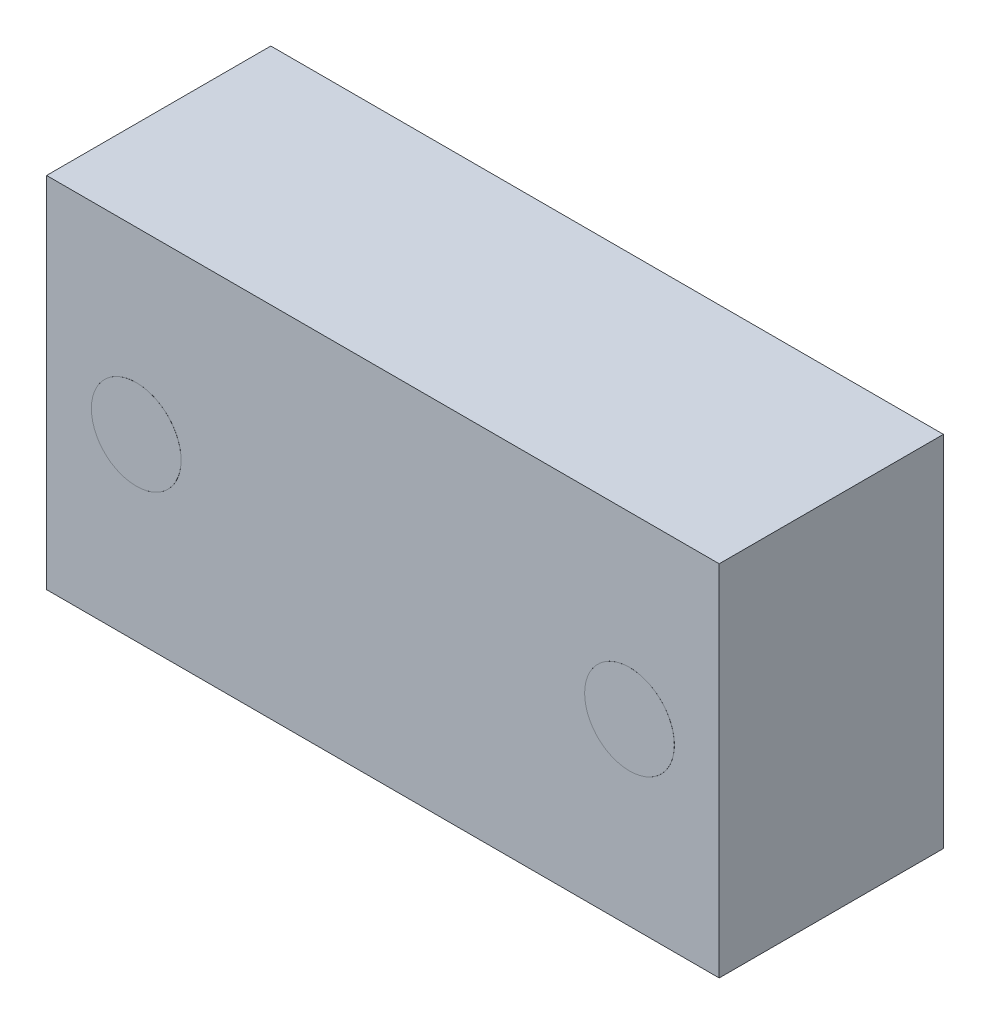
ISO-10303-21;
HEADER;
FILE_DESCRIPTION(('STEP AP214'),'2;1');
FILE_NAME('part.step','',(''),(''),'','','');
FILE_SCHEMA(('AUTOMOTIVE_DESIGN { 1 0 10303 214 1 1 1 1 }'));
ENDSEC;
DATA;
#1=APPLICATION_CONTEXT('core data for automotive mechanical design processes');
#2=APPLICATION_PROTOCOL_DEFINITION('international standard','automotive_design',2000,#1);
#3=PRODUCT_CONTEXT('',#1,'mechanical');
#4=PRODUCT('Part','Part','',(#3));
#5=PRODUCT_RELATED_PRODUCT_CATEGORY('part','',(#4));
#6=PRODUCT_DEFINITION_FORMATION('','',#4);
#7=PRODUCT_DEFINITION_CONTEXT('part definition',#1,'design');
#8=PRODUCT_DEFINITION('design','',#6,#7);
#9=PRODUCT_DEFINITION_SHAPE('','',#8);
#10=(LENGTH_UNIT() NAMED_UNIT(*) SI_UNIT(.MILLI.,.METRE.));
#11=(NAMED_UNIT(*) PLANE_ANGLE_UNIT() SI_UNIT($,.RADIAN.));
#12=(NAMED_UNIT(*) SI_UNIT($,.STERADIAN.) SOLID_ANGLE_UNIT());
#13=UNCERTAINTY_MEASURE_WITH_UNIT(LENGTH_MEASURE(1.E-05),#10,'distance_accuracy_value','');
#14=(GEOMETRIC_REPRESENTATION_CONTEXT(3) GLOBAL_UNCERTAINTY_ASSIGNED_CONTEXT((#13)) GLOBAL_UNIT_ASSIGNED_CONTEXT((#10,
#11,#12)) REPRESENTATION_CONTEXT('',''));
#15=CARTESIAN_POINT('',(0.,0.,0.));
#16=DIRECTION('',(0.,0.,1.));
#17=DIRECTION('',(1.,0.,0.));
#18=AXIS2_PLACEMENT_3D('',#15,#16,#17);
#19=CARTESIAN_POINT('',(0.,0.,5.));
#20=DIRECTION('',(1.,0.,0.));
#21=DIRECTION('',(0.,0.,-1.));
#22=AXIS2_PLACEMENT_3D('',#19,#20,#21);
#23=PLANE('',#22);
#24=DIRECTION('',(0.,-1.,0.));
#25=VECTOR('',#24,1.);
#26=CARTESIAN_POINT('',(0.,0.,0.));
#27=LINE('',#26,#25);
#28=CARTESIAN_POINT('',(0.,8.,0.));
#29=VERTEX_POINT('',#28);
#30=CARTESIAN_POINT('',(0.,0.,0.));
#31=VERTEX_POINT('',#30);
#32=EDGE_CURVE('E111',#29,#31,#27,.T.);
#33=ORIENTED_EDGE('',*,*,#32,.T.);
#34=DIRECTION('',(0.,0.,-1.));
#35=VECTOR('',#34,1.);
#36=CARTESIAN_POINT('',(0.,0.,5.));
#37=LINE('',#36,#35);
#38=CARTESIAN_POINT('',(0.,0.,5.));
#39=VERTEX_POINT('',#38);
#40=EDGE_CURVE('E100',#39,#31,#37,.T.);
#41=ORIENTED_EDGE('',*,*,#40,.F.);
#42=DIRECTION('',(0.,-1.,0.));
#43=VECTOR('',#42,1.);
#44=CARTESIAN_POINT('',(0.,0.,5.));
#45=LINE('',#44,#43);
#46=CARTESIAN_POINT('',(0.,8.,5.));
#47=VERTEX_POINT('',#46);
#48=EDGE_CURVE('E92',#47,#39,#45,.T.);
#49=ORIENTED_EDGE('',*,*,#48,.F.);
#50=DIRECTION('',(0.,0.,-1.));
#51=VECTOR('',#50,1.);
#52=CARTESIAN_POINT('',(0.,8.,5.));
#53=LINE('',#52,#51);
#54=EDGE_CURVE('E107',#47,#29,#53,.T.);
#55=ORIENTED_EDGE('',*,*,#54,.T.);
#56=EDGE_LOOP('',(#33,#41,#49,#55));
#57=FACE_BOUND('',#56,.T.);
#58=ADVANCED_FACE('F39',(#57),#23,.F.);
#59=CARTESIAN_POINT('',(0.,0.,5.));
#60=DIRECTION('',(0.,1.,0.));
#61=DIRECTION('',(0.,0.,1.));
#62=AXIS2_PLACEMENT_3D('',#59,#60,#61);
#63=PLANE('',#62);
#64=DIRECTION('',(1.,0.,0.));
#65=VECTOR('',#64,1.);
#66=CARTESIAN_POINT('',(0.,0.,0.));
#67=LINE('',#66,#65);
#68=CARTESIAN_POINT('',(15.,0.,0.));
#69=VERTEX_POINT('',#68);
#70=EDGE_CURVE('E98',#31,#69,#67,.T.);
#71=ORIENTED_EDGE('',*,*,#70,.T.);
#72=DIRECTION('',(0.,0.,-1.));
#73=VECTOR('',#72,1.);
#74=CARTESIAN_POINT('',(15.,0.,5.));
#75=LINE('',#74,#73);
#76=CARTESIAN_POINT('',(15.,0.,5.));
#77=VERTEX_POINT('',#76);
#78=EDGE_CURVE('E96',#77,#69,#75,.T.);
#79=ORIENTED_EDGE('',*,*,#78,.F.);
#80=DIRECTION('',(1.,0.,0.));
#81=VECTOR('',#80,1.);
#82=CARTESIAN_POINT('',(0.,0.,5.));
#83=LINE('',#82,#81);
#84=EDGE_CURVE('E87',#39,#77,#83,.T.);
#85=ORIENTED_EDGE('',*,*,#84,.F.);
#86=ORIENTED_EDGE('',*,*,#40,.T.);
#87=EDGE_LOOP('',(#71,#79,#85,#86));
#88=FACE_BOUND('',#87,.T.);
#89=ADVANCED_FACE('F97',(#88),#63,.F.);
#90=CARTESIAN_POINT('',(15.,0.,5.));
#91=DIRECTION('',(-1.,0.,0.));
#92=DIRECTION('',(0.,0.,1.));
#93=AXIS2_PLACEMENT_3D('',#90,#91,#92);
#94=PLANE('',#93);
#95=DIRECTION('',(0.,1.,0.));
#96=VECTOR('',#95,1.);
#97=CARTESIAN_POINT('',(15.,0.,0.));
#98=LINE('',#97,#96);
#99=CARTESIAN_POINT('',(15.,8.,0.));
#100=VERTEX_POINT('',#99);
#101=EDGE_CURVE('E73',#69,#100,#98,.T.);
#102=ORIENTED_EDGE('',*,*,#101,.T.);
#103=DIRECTION('',(0.,0.,-1.));
#104=VECTOR('',#103,1.);
#105=CARTESIAN_POINT('',(15.,8.,5.));
#106=LINE('',#105,#104);
#107=CARTESIAN_POINT('',(15.,8.,5.));
#108=VERTEX_POINT('',#107);
#109=EDGE_CURVE('E101',#108,#100,#106,.T.);
#110=ORIENTED_EDGE('',*,*,#109,.F.);
#111=DIRECTION('',(0.,1.,0.));
#112=VECTOR('',#111,1.);
#113=CARTESIAN_POINT('',(15.,0.,5.));
#114=LINE('',#113,#112);
#115=EDGE_CURVE('E90',#77,#108,#114,.T.);
#116=ORIENTED_EDGE('',*,*,#115,.F.);
#117=ORIENTED_EDGE('',*,*,#78,.T.);
#118=EDGE_LOOP('',(#102,#110,#116,#117));
#119=FACE_BOUND('',#118,.T.);
#120=ADVANCED_FACE('F103',(#119),#94,.F.);
#121=CARTESIAN_POINT('',(0.,8.,5.));
#122=DIRECTION('',(0.,-1.,0.));
#123=DIRECTION('',(1.,0.,0.));
#124=AXIS2_PLACEMENT_3D('',#121,#122,#123);
#125=PLANE('',#124);
#126=DIRECTION('',(-1.,0.,0.));
#127=VECTOR('',#126,1.);
#128=CARTESIAN_POINT('',(0.,8.,0.));
#129=LINE('',#128,#127);
#130=EDGE_CURVE('E79',#100,#29,#129,.T.);
#131=ORIENTED_EDGE('',*,*,#130,.T.);
#132=ORIENTED_EDGE('',*,*,#54,.F.);
#133=DIRECTION('',(-1.,0.,0.));
#134=VECTOR('',#133,1.);
#135=CARTESIAN_POINT('',(0.,8.,5.));
#136=LINE('',#135,#134);
#137=EDGE_CURVE('E56',#108,#47,#136,.T.);
#138=ORIENTED_EDGE('',*,*,#137,.F.);
#139=ORIENTED_EDGE('',*,*,#109,.T.);
#140=EDGE_LOOP('',(#131,#132,#138,#139));
#141=FACE_BOUND('',#140,.T.);
#142=ADVANCED_FACE('F163',(#141),#125,.F.);
#143=CARTESIAN_POINT('',(0.,0.,5.));
#144=DIRECTION('',(0.,0.,-1.));
#145=DIRECTION('',(-1.,0.,0.));
#146=AXIS2_PLACEMENT_3D('',#143,#144,#145);
#147=PLANE('',#146);
#148=CARTESIAN_POINT('',(2.,4.,5.));
#149=DIRECTION('',(0.,0.,-1.));
#150=DIRECTION('',(-1.,0.,0.));
#151=AXIS2_PLACEMENT_3D('',#148,#149,#150);
#152=CIRCLE('',#151,1.);
#153=CARTESIAN_POINT('',(0.999999999999999,4.,5.));
#154=VERTEX_POINT('',#153);
#155=EDGE_CURVE('E11',#154,#154,#152,.F.);
#156=ORIENTED_EDGE('',*,*,#155,.F.);
#157=EDGE_LOOP('',(#156));
#158=FACE_BOUND('',#157,.T.);
#159=CARTESIAN_POINT('',(13.,4.,5.));
#160=DIRECTION('',(0.,0.,-1.));
#161=DIRECTION('',(-1.,0.,0.));
#162=AXIS2_PLACEMENT_3D('',#159,#160,#161);
#163=CIRCLE('',#162,1.);
#164=CARTESIAN_POINT('',(12.,4.,5.));
#165=VERTEX_POINT('',#164);
#166=EDGE_CURVE('E48',#165,#165,#163,.F.);
#167=ORIENTED_EDGE('',*,*,#166,.F.);
#168=EDGE_LOOP('',(#167));
#169=FACE_BOUND('',#168,.T.);
#170=ORIENTED_EDGE('',*,*,#48,.T.);
#171=ORIENTED_EDGE('',*,*,#84,.T.);
#172=ORIENTED_EDGE('',*,*,#115,.T.);
#173=ORIENTED_EDGE('',*,*,#137,.T.);
#174=EDGE_LOOP('',(#170,#171,#172,#173));
#175=FACE_BOUND('',#174,.T.);
#176=ADVANCED_FACE('F88',(#158,#169,#175),#147,.F.);
#177=CARTESIAN_POINT('',(0.,0.,0.));
#178=DIRECTION('',(0.,0.,-1.));
#179=DIRECTION('',(-1.,0.,0.));
#180=AXIS2_PLACEMENT_3D('',#177,#178,#179);
#181=PLANE('',#180);
#182=CARTESIAN_POINT('',(7.5,4.,0.));
#183=DIRECTION('',(0.,0.,-1.));
#184=DIRECTION('',(-1.,0.,0.));
#185=AXIS2_PLACEMENT_3D('',#182,#183,#184);
#186=CIRCLE('',#185,3.);
#187=CARTESIAN_POINT('',(4.5,4.,0.));
#188=VERTEX_POINT('',#187);
#189=EDGE_CURVE('E127',#188,#188,#186,.T.);
#190=ORIENTED_EDGE('',*,*,#189,.F.);
#191=EDGE_LOOP('',(#190));
#192=FACE_BOUND('',#191,.T.);
#193=ORIENTED_EDGE('',*,*,#32,.F.);
#194=ORIENTED_EDGE('',*,*,#130,.F.);
#195=ORIENTED_EDGE('',*,*,#101,.F.);
#196=ORIENTED_EDGE('',*,*,#70,.F.);
#197=EDGE_LOOP('',(#193,#194,#195,#196));
#198=FACE_BOUND('',#197,.T.);
#199=ADVANCED_FACE('F162',(#192,#198),#181,.T.);
#200=CARTESIAN_POINT('',(7.5,4.,-0.001));
#201=DIRECTION('',(0.,0.,1.));
#202=DIRECTION('',(1.,0.,0.));
#203=AXIS2_PLACEMENT_3D('',#200,#201,#202);
#204=CYLINDRICAL_SURFACE('',#203,3.);
#205=CARTESIAN_POINT('',(7.5,4.,-0.001));
#206=DIRECTION('',(0.,0.,-1.));
#207=DIRECTION('',(-1.,0.,0.));
#208=AXIS2_PLACEMENT_3D('',#205,#206,#207);
#209=CIRCLE('',#208,3.);
#210=CARTESIAN_POINT('',(4.5,4.,-0.001));
#211=VERTEX_POINT('',#210);
#212=EDGE_CURVE('E115',#211,#211,#209,.T.);
#213=ORIENTED_EDGE('',*,*,#212,.F.);
#214=EDGE_LOOP('',(#213));
#215=FACE_BOUND('',#214,.T.);
#216=ORIENTED_EDGE('',*,*,#189,.T.);
#217=EDGE_LOOP('',(#216));
#218=FACE_BOUND('',#217,.T.);
#219=ADVANCED_FACE('F169',(#215,#218),#204,.T.);
#220=CARTESIAN_POINT('',(7.5,4.,-0.001));
#221=DIRECTION('',(0.,0.,-1.));
#222=DIRECTION('',(-1.,0.,0.));
#223=AXIS2_PLACEMENT_3D('',#220,#221,#222);
#224=PLANE('',#223);
#225=ORIENTED_EDGE('',*,*,#212,.T.);
#226=EDGE_LOOP('',(#225));
#227=FACE_BOUND('',#226,.T.);
#228=ADVANCED_FACE('F207',(#227),#224,.T.);
#229=CARTESIAN_POINT('',(13.,4.,5.001));
#230=DIRECTION('',(0.,0.,-1.));
#231=DIRECTION('',(-1.,0.,0.));
#232=AXIS2_PLACEMENT_3D('',#229,#230,#231);
#233=CYLINDRICAL_SURFACE('',#232,1.);
#234=CARTESIAN_POINT('',(13.,4.,5.001));
#235=DIRECTION('',(0.,0.,1.));
#236=DIRECTION('',(1.,0.,0.));
#237=AXIS2_PLACEMENT_3D('',#234,#235,#236);
#238=CIRCLE('',#237,1.);
#239=CARTESIAN_POINT('',(14.,4.,5.001));
#240=VERTEX_POINT('',#239);
#241=EDGE_CURVE('E143',#240,#240,#238,.T.);
#242=ORIENTED_EDGE('',*,*,#241,.F.);
#243=EDGE_LOOP('',(#242));
#244=FACE_BOUND('',#243,.T.);
#245=ORIENTED_EDGE('',*,*,#166,.T.);
#246=EDGE_LOOP('',(#245));
#247=FACE_BOUND('',#246,.T.);
#248=ADVANCED_FACE('F215',(#244,#247),#233,.T.);
#249=CARTESIAN_POINT('',(13.,4.,5.001));
#250=DIRECTION('',(0.,0.,1.));
#251=DIRECTION('',(1.,0.,0.));
#252=AXIS2_PLACEMENT_3D('',#249,#250,#251);
#253=PLANE('',#252);
#254=ORIENTED_EDGE('',*,*,#241,.T.);
#255=EDGE_LOOP('',(#254));
#256=FACE_BOUND('',#255,.T.);
#257=ADVANCED_FACE('F156',(#256),#253,.T.);
#258=CARTESIAN_POINT('',(2.,4.,5.001));
#259=DIRECTION('',(0.,0.,-1.));
#260=DIRECTION('',(-1.,0.,0.));
#261=AXIS2_PLACEMENT_3D('',#258,#259,#260);
#262=CYLINDRICAL_SURFACE('',#261,1.);
#263=CARTESIAN_POINT('',(2.,4.,5.001));
#264=DIRECTION('',(0.,0.,1.));
#265=DIRECTION('',(1.,0.,0.));
#266=AXIS2_PLACEMENT_3D('',#263,#264,#265);
#267=CIRCLE('',#266,1.);
#268=CARTESIAN_POINT('',(3.,4.,5.001));
#269=VERTEX_POINT('',#268);
#270=EDGE_CURVE('E146',#269,#269,#267,.T.);
#271=ORIENTED_EDGE('',*,*,#270,.F.);
#272=EDGE_LOOP('',(#271));
#273=FACE_BOUND('',#272,.T.);
#274=ORIENTED_EDGE('',*,*,#155,.T.);
#275=EDGE_LOOP('',(#274));
#276=FACE_BOUND('',#275,.T.);
#277=ADVANCED_FACE('F153',(#273,#276),#262,.T.);
#278=CARTESIAN_POINT('',(2.,4.,5.001));
#279=DIRECTION('',(0.,0.,1.));
#280=DIRECTION('',(1.,0.,0.));
#281=AXIS2_PLACEMENT_3D('',#278,#279,#280);
#282=PLANE('',#281);
#283=ORIENTED_EDGE('',*,*,#270,.T.);
#284=EDGE_LOOP('',(#283));
#285=FACE_BOUND('',#284,.T.);
#286=ADVANCED_FACE('F151',(#285),#282,.T.);
#287=CLOSED_SHELL('',(#58,#89,#120,#142,#176,#199,#219,#228,#248,#257,#277,#286));
#288=MANIFOLD_SOLID_BREP('B2',#287);
#289=ADVANCED_BREP_SHAPE_REPRESENTATION('',(#18,#288),#14);
#290=SHAPE_DEFINITION_REPRESENTATION(#9,#289);
ENDSEC;
END-ISO-10303-21;
